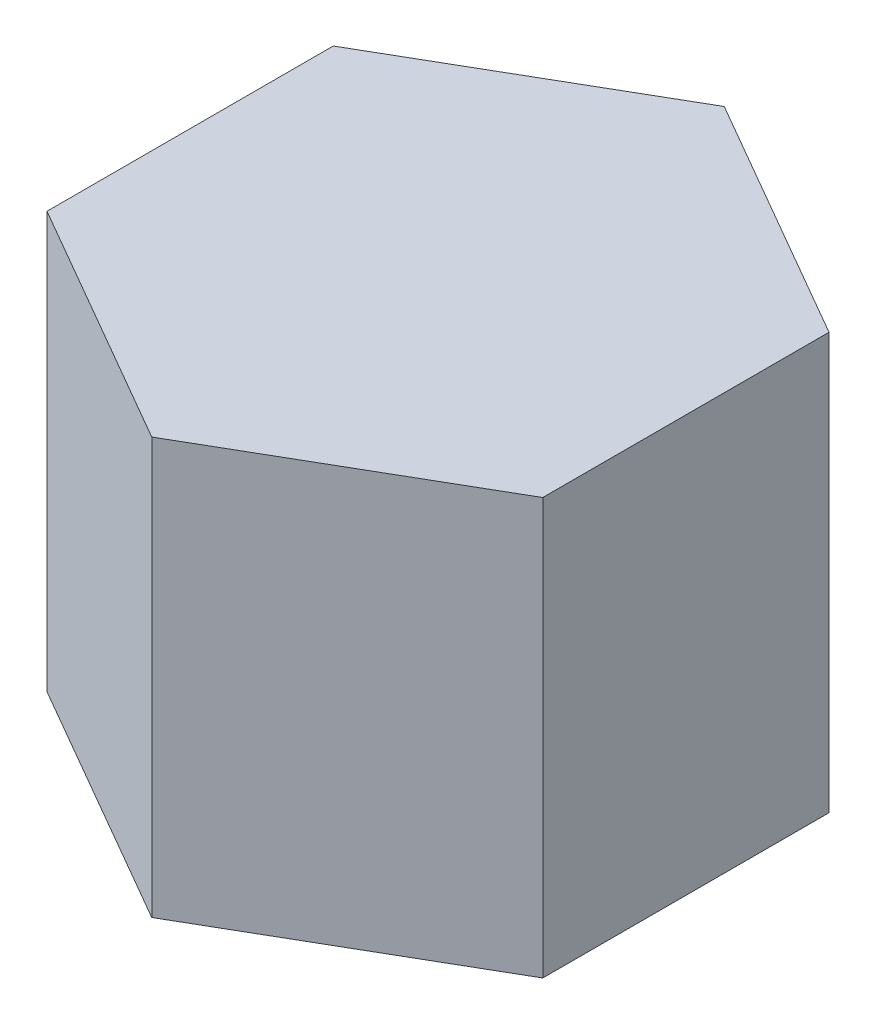
ISO-10303-21;
HEADER;
FILE_DESCRIPTION(('STEP AP214'),'2;1');
FILE_NAME('part.step','',(''),(''),'','','');
FILE_SCHEMA(('AUTOMOTIVE_DESIGN { 1 0 10303 214 1 1 1 1 }'));
ENDSEC;
DATA;
#1=APPLICATION_CONTEXT('core data for automotive mechanical design processes');
#2=APPLICATION_PROTOCOL_DEFINITION('international standard','automotive_design',2000,#1);
#3=PRODUCT_CONTEXT('',#1,'mechanical');
#4=PRODUCT('Part','Part','',(#3));
#5=PRODUCT_RELATED_PRODUCT_CATEGORY('part','',(#4));
#6=PRODUCT_DEFINITION_FORMATION('','',#4);
#7=PRODUCT_DEFINITION_CONTEXT('part definition',#1,'design');
#8=PRODUCT_DEFINITION('design','',#6,#7);
#9=PRODUCT_DEFINITION_SHAPE('','',#8);
#10=(LENGTH_UNIT() NAMED_UNIT(*) SI_UNIT(.MILLI.,.METRE.));
#11=(NAMED_UNIT(*) PLANE_ANGLE_UNIT() SI_UNIT($,.RADIAN.));
#12=(NAMED_UNIT(*) SI_UNIT($,.STERADIAN.) SOLID_ANGLE_UNIT());
#13=UNCERTAINTY_MEASURE_WITH_UNIT(LENGTH_MEASURE(1.E-05),#10,'distance_accuracy_value','');
#14=(GEOMETRIC_REPRESENTATION_CONTEXT(3) GLOBAL_UNCERTAINTY_ASSIGNED_CONTEXT((#13)) GLOBAL_UNIT_ASSIGNED_CONTEXT((#10,
#11,#12)) REPRESENTATION_CONTEXT('',''));
#15=CARTESIAN_POINT('',(0.,0.,0.));
#16=DIRECTION('',(0.,0.,1.));
#17=DIRECTION('',(1.,0.,0.));
#18=AXIS2_PLACEMENT_3D('',#15,#16,#17);
#19=CARTESIAN_POINT('',(204.339551417382,-147.556598747966,293.414022028063));
#20=DIRECTION('',(-0.500000000000096,0.,-0.866025403784383));
#21=DIRECTION('',(-0.866025403784383,0.,0.500000000000096));
#22=AXIS2_PLACEMENT_3D('',#19,#20,#21);
#23=PLANE('',#22);
#24=CARTESIAN_POINT('',(204.642660308706,-147.047793579175,293.239022028063));
#25=DIRECTION('',(-0.866025403784383,0.,0.500000000000096));
#26=VECTOR('',#25,1.);
#27=LINE('',#24,#26);
#28=CARTESIAN_POINT('',(204.642660308706,-147.047793579175,293.239022028063));
#29=VERTEX_POINT('',#28);
#30=CARTESIAN_POINT('',(204.339551417382,-147.047793579175,293.414022028063));
#31=VERTEX_POINT('',#30);
#32=EDGE_CURVE('E170',#29,#31,#27,.T.);
#33=ORIENTED_EDGE('',*,*,#32,.T.);
#34=CARTESIAN_POINT('',(204.339551417382,-147.556598747966,293.414022028063));
#35=DIRECTION('',(0.,1.,0.));
#36=VECTOR('',#35,1.);
#37=LINE('',#34,#36);
#38=CARTESIAN_POINT('',(204.339551417382,-147.556598747966,293.414022028063));
#39=VERTEX_POINT('',#38);
#40=EDGE_CURVE('E35',#39,#31,#37,.T.);
#41=ORIENTED_EDGE('',*,*,#40,.F.);
#42=CARTESIAN_POINT('',(204.642660308706,-147.556598747966,293.239022028063));
#43=DIRECTION('',(-0.866025403784383,0.,0.500000000000096));
#44=VECTOR('',#43,1.);
#45=LINE('',#42,#44);
#46=CARTESIAN_POINT('',(204.642660308706,-147.556598747966,293.239022028063));
#47=VERTEX_POINT('',#46);
#48=EDGE_CURVE('E159',#47,#39,#45,.T.);
#49=ORIENTED_EDGE('',*,*,#48,.F.);
#50=CARTESIAN_POINT('',(204.642660308706,-147.556598747966,293.239022028063));
#51=DIRECTION('',(0.,1.,0.));
#52=VECTOR('',#51,1.);
#53=LINE('',#50,#52);
#54=EDGE_CURVE('E10',#47,#29,#53,.T.);
#55=ORIENTED_EDGE('',*,*,#54,.T.);
#56=EDGE_LOOP('',(#33,#41,#49,#55));
#57=FACE_BOUND('',#56,.T.);
#58=ADVANCED_FACE('F16',(#57),#23,.F.);
#59=CARTESIAN_POINT('',(204.642660308706,-147.556598747966,291.594471220494));
#60=DIRECTION('',(-1.,0.,0.));
#61=DIRECTION('',(0.,-1.,0.));
#62=AXIS2_PLACEMENT_3D('',#59,#60,#61);
#63=PLANE('',#62);
#64=CARTESIAN_POINT('',(204.642660308706,-147.047793579175,292.889022028063));
#65=DIRECTION('',(0.,0.,1.));
#66=VECTOR('',#65,1.);
#67=LINE('',#64,#66);
#68=CARTESIAN_POINT('',(204.642660308706,-147.047793579175,292.889022028063));
#69=VERTEX_POINT('',#68);
#70=EDGE_CURVE('E167',#69,#29,#67,.T.);
#71=ORIENTED_EDGE('',*,*,#70,.T.);
#72=ORIENTED_EDGE('',*,*,#54,.F.);
#73=CARTESIAN_POINT('',(204.642660308706,-147.556598747966,292.889022028063));
#74=DIRECTION('',(0.,0.,1.));
#75=VECTOR('',#74,1.);
#76=LINE('',#73,#75);
#77=CARTESIAN_POINT('',(204.642660308706,-147.556598747966,292.889022028063));
#78=VERTEX_POINT('',#77);
#79=EDGE_CURVE('E156',#78,#47,#76,.T.);
#80=ORIENTED_EDGE('',*,*,#79,.F.);
#81=CARTESIAN_POINT('',(204.642660308706,-147.556598747966,292.889022028063));
#82=DIRECTION('',(0.,1.,0.));
#83=VECTOR('',#82,1.);
#84=LINE('',#81,#83);
#85=EDGE_CURVE('E27',#78,#69,#84,.T.);
#86=ORIENTED_EDGE('',*,*,#85,.T.);
#87=EDGE_LOOP('',(#71,#72,#80,#86));
#88=FACE_BOUND('',#87,.T.);
#89=ADVANCED_FACE('F189',(#88),#63,.F.);
#90=CARTESIAN_POINT('',(204.642660308706,-147.556598747966,292.889022028063));
#91=DIRECTION('',(-0.500000000000062,0.,0.866025403784403));
#92=DIRECTION('',(0.866025403784403,0.,0.500000000000062));
#93=AXIS2_PLACEMENT_3D('',#90,#91,#92);
#94=PLANE('',#93);
#95=CARTESIAN_POINT('',(204.339551417381,-147.047793579175,292.714022028063));
#96=DIRECTION('',(0.866025403784403,0.,0.500000000000062));
#97=VECTOR('',#96,1.);
#98=LINE('',#95,#97);
#99=CARTESIAN_POINT('',(204.339551417382,-147.047793579175,292.714022028063));
#100=VERTEX_POINT('',#99);
#101=EDGE_CURVE('E163',#100,#69,#98,.T.);
#102=ORIENTED_EDGE('',*,*,#101,.T.);
#103=ORIENTED_EDGE('',*,*,#85,.F.);
#104=CARTESIAN_POINT('',(204.339551417381,-147.556598747966,292.714022028063));
#105=DIRECTION('',(0.866025403784403,0.,0.500000000000062));
#106=VECTOR('',#105,1.);
#107=LINE('',#104,#106);
#108=CARTESIAN_POINT('',(204.339551417382,-147.556598747966,292.714022028063));
#109=VERTEX_POINT('',#108);
#110=EDGE_CURVE('E106',#109,#78,#107,.T.);
#111=ORIENTED_EDGE('',*,*,#110,.F.);
#112=CARTESIAN_POINT('',(204.339551417381,-147.556598747966,292.714022028063));
#113=DIRECTION('',(0.,1.,0.));
#114=VECTOR('',#113,1.);
#115=LINE('',#112,#114);
#116=EDGE_CURVE('E94',#109,#100,#115,.T.);
#117=ORIENTED_EDGE('',*,*,#116,.T.);
#118=EDGE_LOOP('',(#102,#103,#111,#117));
#119=FACE_BOUND('',#118,.T.);
#120=ADVANCED_FACE('F198',(#119),#94,.F.);
#121=CARTESIAN_POINT('',(204.339551417382,-147.556598747966,292.714022028063));
#122=DIRECTION('',(0.500000000000062,0.,0.866025403784403));
#123=DIRECTION('',(0.866025403784403,0.,-0.500000000000062));
#124=AXIS2_PLACEMENT_3D('',#121,#122,#123);
#125=PLANE('',#124);
#126=CARTESIAN_POINT('',(204.036442526057,-147.047793579175,292.889022028063));
#127=DIRECTION('',(0.866025403784403,0.,-0.500000000000062));
#128=VECTOR('',#127,1.);
#129=LINE('',#126,#128);
#130=CARTESIAN_POINT('',(204.036442526057,-147.047793579175,292.889022028063));
#131=VERTEX_POINT('',#130);
#132=EDGE_CURVE('E162',#131,#100,#129,.T.);
#133=ORIENTED_EDGE('',*,*,#132,.T.);
#134=ORIENTED_EDGE('',*,*,#116,.F.);
#135=CARTESIAN_POINT('',(204.036442526057,-147.556598747966,292.889022028063));
#136=DIRECTION('',(0.866025403784403,0.,-0.500000000000062));
#137=VECTOR('',#136,1.);
#138=LINE('',#135,#137);
#139=CARTESIAN_POINT('',(204.036442526057,-147.556598747966,292.889022028063));
#140=VERTEX_POINT('',#139);
#141=EDGE_CURVE('E98',#140,#109,#138,.T.);
#142=ORIENTED_EDGE('',*,*,#141,.F.);
#143=CARTESIAN_POINT('',(204.036442526057,-147.556598747966,292.889022028063));
#144=DIRECTION('',(0.,1.,0.));
#145=VECTOR('',#144,1.);
#146=LINE('',#143,#145);
#147=EDGE_CURVE('E79',#140,#131,#146,.T.);
#148=ORIENTED_EDGE('',*,*,#147,.T.);
#149=EDGE_LOOP('',(#133,#134,#142,#148));
#150=FACE_BOUND('',#149,.T.);
#151=ADVANCED_FACE('F100',(#150),#125,.F.);
#152=CARTESIAN_POINT('',(204.036442526057,-147.556598747966,291.594471220494));
#153=DIRECTION('',(1.,0.,0.));
#154=DIRECTION('',(0.,1.,0.));
#155=AXIS2_PLACEMENT_3D('',#152,#153,#154);
#156=PLANE('',#155);
#157=CARTESIAN_POINT('',(204.036442526057,-147.047793579175,293.239022028063));
#158=DIRECTION('',(0.,0.,-1.));
#159=VECTOR('',#158,1.);
#160=LINE('',#157,#159);
#161=CARTESIAN_POINT('',(204.036442526057,-147.047793579175,293.239022028063));
#162=VERTEX_POINT('',#161);
#163=EDGE_CURVE('E88',#162,#131,#160,.T.);
#164=ORIENTED_EDGE('',*,*,#163,.T.);
#165=ORIENTED_EDGE('',*,*,#147,.F.);
#166=CARTESIAN_POINT('',(204.036442526057,-147.556598747966,293.239022028063));
#167=DIRECTION('',(0.,0.,-1.));
#168=VECTOR('',#167,1.);
#169=LINE('',#166,#168);
#170=CARTESIAN_POINT('',(204.036442526057,-147.556598747966,293.239022028063));
#171=VERTEX_POINT('',#170);
#172=EDGE_CURVE('E84',#171,#140,#169,.T.);
#173=ORIENTED_EDGE('',*,*,#172,.F.);
#174=CARTESIAN_POINT('',(204.036442526057,-147.556598747966,293.239022028063));
#175=DIRECTION('',(0.,1.,0.));
#176=VECTOR('',#175,1.);
#177=LINE('',#174,#176);
#178=EDGE_CURVE('E58',#171,#162,#177,.T.);
#179=ORIENTED_EDGE('',*,*,#178,.T.);
#180=EDGE_LOOP('',(#164,#165,#173,#179));
#181=FACE_BOUND('',#180,.T.);
#182=ADVANCED_FACE('F82',(#181),#156,.F.);
#183=CARTESIAN_POINT('',(204.036442526057,-147.556598747966,293.239022028063));
#184=DIRECTION('',(0.500000000000062,0.,-0.866025403784403));
#185=DIRECTION('',(-0.866025403784403,0.,-0.500000000000062));
#186=AXIS2_PLACEMENT_3D('',#183,#184,#185);
#187=PLANE('',#186);
#188=CARTESIAN_POINT('',(204.339551417382,-147.047793579175,293.414022028063));
#189=DIRECTION('',(-0.866025403784403,0.,-0.500000000000062));
#190=VECTOR('',#189,1.);
#191=LINE('',#188,#190);
#192=EDGE_CURVE('E160',#31,#162,#191,.T.);
#193=ORIENTED_EDGE('',*,*,#192,.T.);
#194=ORIENTED_EDGE('',*,*,#178,.F.);
#195=CARTESIAN_POINT('',(204.339551417382,-147.556598747966,293.414022028063));
#196=DIRECTION('',(-0.866025403784403,0.,-0.500000000000062));
#197=VECTOR('',#196,1.);
#198=LINE('',#195,#197);
#199=EDGE_CURVE('E112',#39,#171,#198,.T.);
#200=ORIENTED_EDGE('',*,*,#199,.F.);
#201=ORIENTED_EDGE('',*,*,#40,.T.);
#202=EDGE_LOOP('',(#193,#194,#200,#201));
#203=FACE_BOUND('',#202,.T.);
#204=ADVANCED_FACE('F131',(#203),#187,.F.);
#205=CARTESIAN_POINT('',(206.491105863044,-147.556598747966,291.594471220494));
#206=DIRECTION('',(0.,1.,0.));
#207=DIRECTION('',(-1.,0.,0.));
#208=AXIS2_PLACEMENT_3D('',#205,#206,#207);
#209=PLANE('',#208);
#210=ORIENTED_EDGE('',*,*,#48,.T.);
#211=ORIENTED_EDGE('',*,*,#199,.T.);
#212=ORIENTED_EDGE('',*,*,#172,.T.);
#213=ORIENTED_EDGE('',*,*,#141,.T.);
#214=ORIENTED_EDGE('',*,*,#110,.T.);
#215=ORIENTED_EDGE('',*,*,#79,.T.);
#216=EDGE_LOOP('',(#210,#211,#212,#213,#214,#215));
#217=FACE_BOUND('',#216,.T.);
#218=ADVANCED_FACE('F111',(#217),#209,.F.);
#219=CARTESIAN_POINT('',(206.491105863044,-147.047793579175,291.594471220494));
#220=DIRECTION('',(0.,1.,0.));
#221=DIRECTION('',(-1.,0.,0.));
#222=AXIS2_PLACEMENT_3D('',#219,#220,#221);
#223=PLANE('',#222);
#224=ORIENTED_EDGE('',*,*,#32,.F.);
#225=ORIENTED_EDGE('',*,*,#70,.F.);
#226=ORIENTED_EDGE('',*,*,#101,.F.);
#227=ORIENTED_EDGE('',*,*,#132,.F.);
#228=ORIENTED_EDGE('',*,*,#163,.F.);
#229=ORIENTED_EDGE('',*,*,#192,.F.);
#230=EDGE_LOOP('',(#224,#225,#226,#227,#228,#229));
#231=FACE_BOUND('',#230,.T.);
#232=ADVANCED_FACE('F130',(#231),#223,.T.);
#233=CLOSED_SHELL('',(#58,#89,#120,#151,#182,#204,#218,#232));
#234=MANIFOLD_SOLID_BREP('B1',#233);
#235=ADVANCED_BREP_SHAPE_REPRESENTATION('',(#18,#234),#14);
#236=SHAPE_DEFINITION_REPRESENTATION(#9,#235);
ENDSEC;
END-ISO-10303-21;
